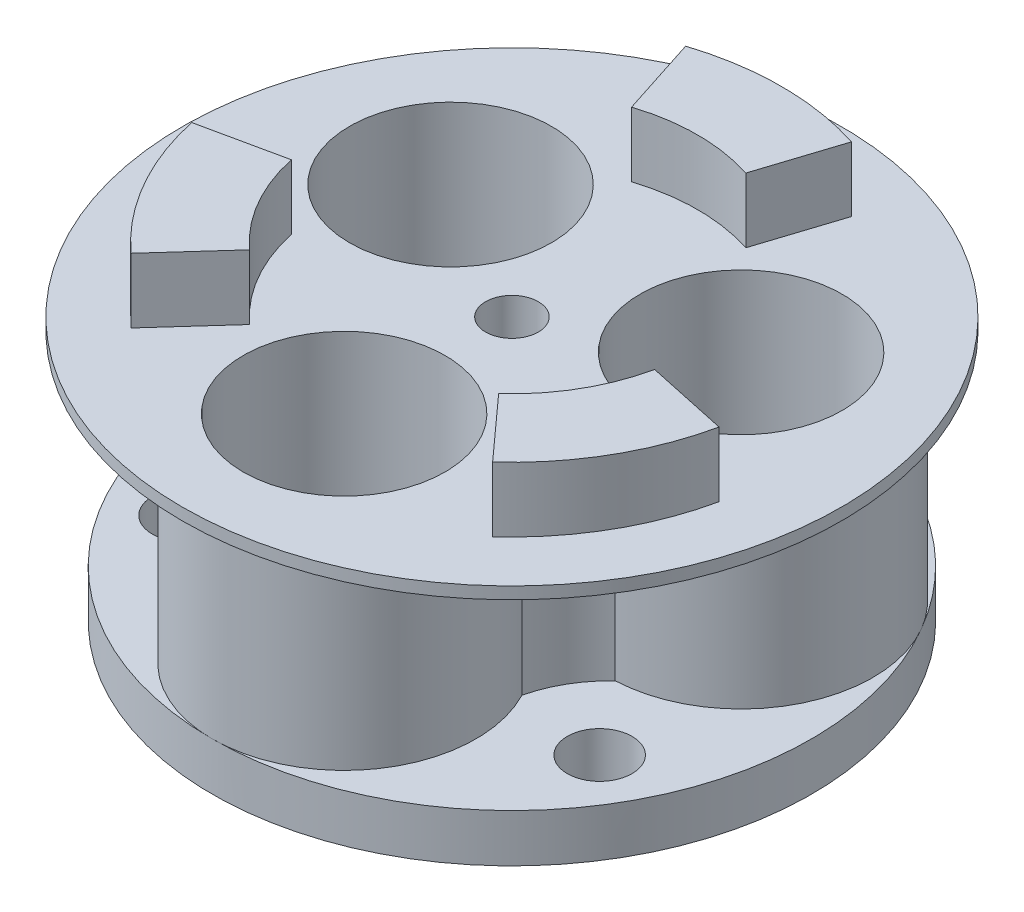
ISO-10303-21;
HEADER;
FILE_DESCRIPTION(('STEP AP214'),'2;1');
FILE_NAME('part.step','',(''),(''),'','','');
FILE_SCHEMA(('AUTOMOTIVE_DESIGN { 1 0 10303 214 1 1 1 1 }'));
ENDSEC;
DATA;
#1=APPLICATION_CONTEXT('core data for automotive mechanical design processes');
#2=APPLICATION_PROTOCOL_DEFINITION('international standard','automotive_design',2000,#1);
#3=PRODUCT_CONTEXT('',#1,'mechanical');
#4=PRODUCT('Part','Part','',(#3));
#5=PRODUCT_RELATED_PRODUCT_CATEGORY('part','',(#4));
#6=PRODUCT_DEFINITION_FORMATION('','',#4);
#7=PRODUCT_DEFINITION_CONTEXT('part definition',#1,'design');
#8=PRODUCT_DEFINITION('design','',#6,#7);
#9=PRODUCT_DEFINITION_SHAPE('','',#8);
#10=(LENGTH_UNIT() NAMED_UNIT(*) SI_UNIT(.MILLI.,.METRE.));
#11=(NAMED_UNIT(*) PLANE_ANGLE_UNIT() SI_UNIT($,.RADIAN.));
#12=(NAMED_UNIT(*) SI_UNIT($,.STERADIAN.) SOLID_ANGLE_UNIT());
#13=UNCERTAINTY_MEASURE_WITH_UNIT(LENGTH_MEASURE(1.E-05),#10,'distance_accuracy_value','');
#14=(GEOMETRIC_REPRESENTATION_CONTEXT(3) GLOBAL_UNCERTAINTY_ASSIGNED_CONTEXT((#13)) GLOBAL_UNIT_ASSIGNED_CONTEXT((#10,
#11,#12)) REPRESENTATION_CONTEXT('',''));
#15=CARTESIAN_POINT('',(0.,0.,0.));
#16=DIRECTION('',(0.,0.,1.));
#17=DIRECTION('',(1.,0.,0.));
#18=AXIS2_PLACEMENT_3D('',#15,#16,#17);
#19=CARTESIAN_POINT('',(0.,0.,0.));
#20=DIRECTION('',(0.,1.,0.));
#21=DIRECTION('',(0.,0.,1.));
#22=AXIS2_PLACEMENT_3D('',#19,#20,#21);
#23=PLANE('',#22);
#24=CARTESIAN_POINT('',(12.1243556529822,0.,-6.99999999999989));
#25=DIRECTION('',(0.,1.,0.));
#26=DIRECTION('',(0.,0.,1.));
#27=AXIS2_PLACEMENT_3D('',#24,#25,#26);
#28=CIRCLE('',#27,8.425);
#29=CARTESIAN_POINT('',(12.1243556529822,0.,1.42500000000011));
#30=VERTEX_POINT('',#29);
#31=EDGE_CURVE('E367',#30,#30,#28,.T.);
#32=ORIENTED_EDGE('',*,*,#31,.T.);
#33=EDGE_LOOP('',(#32));
#34=FACE_BOUND('',#33,.T.);
#35=CARTESIAN_POINT('',(-12.1243556529821,0.,-7.00000000000006));
#36=DIRECTION('',(0.,1.,0.));
#37=DIRECTION('',(0.,0.,1.));
#38=AXIS2_PLACEMENT_3D('',#35,#36,#37);
#39=CIRCLE('',#38,8.425);
#40=CARTESIAN_POINT('',(-12.1243556529821,0.,1.42499999999994));
#41=VERTEX_POINT('',#40);
#42=EDGE_CURVE('E372',#41,#41,#39,.T.);
#43=ORIENTED_EDGE('',*,*,#42,.T.);
#44=EDGE_LOOP('',(#43));
#45=FACE_BOUND('',#44,.T.);
#46=CARTESIAN_POINT('',(0.,0.,14.));
#47=DIRECTION('',(0.,1.,0.));
#48=DIRECTION('',(0.,0.,1.));
#49=AXIS2_PLACEMENT_3D('',#46,#47,#48);
#50=CIRCLE('',#49,8.425);
#51=CARTESIAN_POINT('',(0.,0.,22.425));
#52=VERTEX_POINT('',#51);
#53=EDGE_CURVE('E380',#52,#52,#50,.T.);
#54=ORIENTED_EDGE('',*,*,#53,.T.);
#55=EDGE_LOOP('',(#54));
#56=FACE_BOUND('',#55,.T.);
#57=CARTESIAN_POINT('',(0.,0.,0.));
#58=DIRECTION('',(0.,1.,0.));
#59=DIRECTION('',(0.,0.,1.));
#60=AXIS2_PLACEMENT_3D('',#57,#58,#59);
#61=CIRCLE('',#60,2.2);
#62=CARTESIAN_POINT('',(0.,0.,2.2));
#63=VERTEX_POINT('',#62);
#64=EDGE_CURVE('E388',#63,#63,#61,.T.);
#65=ORIENTED_EDGE('',*,*,#64,.T.);
#66=EDGE_LOOP('',(#65));
#67=FACE_BOUND('',#66,.T.);
#68=CARTESIAN_POINT('',(17.3205080756888,0.,10.));
#69=DIRECTION('',(0.,-1.,0.));
#70=DIRECTION('',(0.,0.,-1.));
#71=AXIS2_PLACEMENT_3D('',#68,#69,#70);
#72=CIRCLE('',#71,2.7);
#73=CARTESIAN_POINT('',(17.3205080756888,0.,7.30000000000001));
#74=VERTEX_POINT('',#73);
#75=EDGE_CURVE('E197',#74,#74,#72,.T.);
#76=ORIENTED_EDGE('',*,*,#75,.F.);
#77=EDGE_LOOP('',(#76));
#78=FACE_BOUND('',#77,.T.);
#79=CARTESIAN_POINT('',(-17.3205080756888,0.,10.));
#80=DIRECTION('',(0.,-1.,0.));
#81=DIRECTION('',(0.,0.,-1.));
#82=AXIS2_PLACEMENT_3D('',#79,#80,#81);
#83=CIRCLE('',#82,2.7);
#84=CARTESIAN_POINT('',(-17.3205080756888,0.,7.3));
#85=VERTEX_POINT('',#84);
#86=EDGE_CURVE('E867',#85,#85,#83,.T.);
#87=ORIENTED_EDGE('',*,*,#86,.F.);
#88=EDGE_LOOP('',(#87));
#89=FACE_BOUND('',#88,.T.);
#90=CARTESIAN_POINT('',(0.,0.,-20.));
#91=DIRECTION('',(0.,-1.,0.));
#92=DIRECTION('',(0.,0.,-1.));
#93=AXIS2_PLACEMENT_3D('',#90,#91,#92);
#94=CIRCLE('',#93,2.7);
#95=CARTESIAN_POINT('',(0.,0.,-22.7));
#96=VERTEX_POINT('',#95);
#97=EDGE_CURVE('E405',#96,#96,#94,.T.);
#98=ORIENTED_EDGE('',*,*,#97,.F.);
#99=EDGE_LOOP('',(#98));
#100=FACE_BOUND('',#99,.T.);
#101=CARTESIAN_POINT('',(0.,0.,0.));
#102=DIRECTION('',(0.,-1.,0.));
#103=DIRECTION('',(0.,0.,-1.));
#104=AXIS2_PLACEMENT_3D('',#101,#102,#103);
#105=CIRCLE('',#104,25.);
#106=CARTESIAN_POINT('',(0.,0.,-25.));
#107=VERTEX_POINT('',#106);
#108=EDGE_CURVE('E185',#107,#107,#105,.T.);
#109=ORIENTED_EDGE('',*,*,#108,.T.);
#110=EDGE_LOOP('',(#109));
#111=FACE_BOUND('',#110,.T.);
#112=ADVANCED_FACE('F41',(#34,#45,#56,#67,#78,#89,#100,#111),#23,.F.);
#113=CARTESIAN_POINT('',(0.,4.,0.));
#114=DIRECTION('',(0.,1.,0.));
#115=DIRECTION('',(0.,0.,1.));
#116=AXIS2_PLACEMENT_3D('',#113,#114,#115);
#117=PLANE('',#116);
#118=CARTESIAN_POINT('',(17.3205080756888,4.,10.));
#119=DIRECTION('',(0.,1.,0.));
#120=DIRECTION('',(0.,0.,1.));
#121=AXIS2_PLACEMENT_3D('',#118,#119,#120);
#122=CIRCLE('',#121,2.7);
#123=CARTESIAN_POINT('',(17.3205080756888,4.,12.7));
#124=VERTEX_POINT('',#123);
#125=EDGE_CURVE('E401',#124,#124,#122,.T.);
#126=ORIENTED_EDGE('',*,*,#125,.F.);
#127=EDGE_LOOP('',(#126));
#128=FACE_BOUND('',#127,.T.);
#129=CARTESIAN_POINT('',(1.42649182304901E-12,4.,13.9999999999991));
#130=DIRECTION('',(0.,1.,0.));
#131=DIRECTION('',(0.,0.,1.));
#132=AXIS2_PLACEMENT_3D('',#129,#130,#131);
#133=CIRCLE('',#132,11.);
#134=CARTESIAN_POINT('',(2.5473068268733E-12,4.,24.9999999999991));
#135=VERTEX_POINT('',#134);
#136=CARTESIAN_POINT('',(9.75951782142741,4.,8.92537568944486));
#137=VERTEX_POINT('',#136);
#138=EDGE_CURVE('E194',#135,#137,#133,.T.);
#139=ORIENTED_EDGE('',*,*,#138,.F.);
#140=CARTESIAN_POINT('',(0.,4.,0.));
#141=DIRECTION('',(0.,-1.,0.));
#142=DIRECTION('',(0.,0.,-1.));
#143=AXIS2_PLACEMENT_3D('',#140,#141,#142);
#144=CIRCLE('',#143,25.);
#145=CARTESIAN_POINT('',(21.6506350946097,4.,-12.5000000000022));
#146=VERTEX_POINT('',#145);
#147=EDGE_CURVE('E59',#146,#135,#144,.T.);
#148=ORIENTED_EDGE('',*,*,#147,.F.);
#149=CARTESIAN_POINT('',(12.1243556529822,4.,-7.00000000000166));
#150=DIRECTION('',(0.,1.,0.));
#151=DIRECTION('',(0.,0.,1.));
#152=AXIS2_PLACEMENT_3D('',#149,#150,#151);
#153=CIRCLE('',#152,11.);
#154=CARTESIAN_POINT('',(12.6093609960954,4.,3.98930251731724));
#155=VERTEX_POINT('',#154);
#156=EDGE_CURVE('E193',#155,#146,#153,.T.);
#157=ORIENTED_EDGE('',*,*,#156,.F.);
#158=CARTESIAN_POINT('',(19.4855715851499,4.,11.2499999999983));
#159=DIRECTION('',(0.,1.,0.));
#160=DIRECTION('',(0.,0.,1.));
#161=AXIS2_PLACEMENT_3D('',#158,#159,#160);
#162=CIRCLE('',#161,10.0000000000018);
#163=EDGE_CURVE('E213',#155,#137,#162,.T.);
#164=ORIENTED_EDGE('',*,*,#163,.T.);
#165=EDGE_LOOP('',(#139,#148,#157,#164));
#166=FACE_BOUND('',#165,.T.);
#167=ADVANCED_FACE('F190',(#128,#166),#117,.T.);
#168=CARTESIAN_POINT('',(0.,4.,-20.));
#169=DIRECTION('',(0.,1.,0.));
#170=DIRECTION('',(0.,0.,1.));
#171=AXIS2_PLACEMENT_3D('',#168,#169,#170);
#172=CIRCLE('',#171,2.7);
#173=CARTESIAN_POINT('',(0.,4.,-17.3));
#174=VERTEX_POINT('',#173);
#175=EDGE_CURVE('E45',#174,#174,#172,.T.);
#176=ORIENTED_EDGE('',*,*,#175,.F.);
#177=EDGE_LOOP('',(#176));
#178=FACE_BOUND('',#177,.T.);
#179=CARTESIAN_POINT('',(2.84984317466854,4.,-12.9146782067687));
#180=VERTEX_POINT('',#179);
#181=EDGE_CURVE('E199',#146,#180,#153,.T.);
#182=ORIENTED_EDGE('',*,*,#181,.F.);
#183=CARTESIAN_POINT('',(-21.6506350946109,4.,-12.5000000000001));
#184=VERTEX_POINT('',#183);
#185=EDGE_CURVE('E176',#184,#146,#144,.T.);
#186=ORIENTED_EDGE('',*,*,#185,.F.);
#187=CARTESIAN_POINT('',(-12.1243556529821,4.,-7.00000000000006));
#188=DIRECTION('',(0.,1.,0.));
#189=DIRECTION('',(0.,0.,1.));
#190=AXIS2_PLACEMENT_3D('',#187,#188,#189);
#191=CIRCLE('',#190,11.);
#192=CARTESIAN_POINT('',(-2.84984317466973,4.,-12.914678206769));
#193=VERTEX_POINT('',#192);
#194=EDGE_CURVE('E427',#193,#184,#191,.T.);
#195=ORIENTED_EDGE('',*,*,#194,.F.);
#196=CARTESIAN_POINT('',(0.,4.,-22.5));
#197=DIRECTION('',(0.,1.,0.));
#198=DIRECTION('',(0.,0.,1.));
#199=AXIS2_PLACEMENT_3D('',#196,#197,#198);
#200=CIRCLE('',#199,10.);
#201=EDGE_CURVE('E202',#193,#180,#200,.T.);
#202=ORIENTED_EDGE('',*,*,#201,.T.);
#203=EDGE_LOOP('',(#182,#186,#195,#202));
#204=FACE_BOUND('',#203,.T.);
#205=ADVANCED_FACE('F200',(#178,#204),#117,.T.);
#206=CARTESIAN_POINT('',(-17.3205080756888,4.,10.));
#207=DIRECTION('',(0.,1.,0.));
#208=DIRECTION('',(0.,0.,1.));
#209=AXIS2_PLACEMENT_3D('',#206,#207,#208);
#210=CIRCLE('',#209,2.7);
#211=CARTESIAN_POINT('',(-17.3205080756888,4.,12.7));
#212=VERTEX_POINT('',#211);
#213=EDGE_CURVE('E404',#212,#212,#210,.T.);
#214=ORIENTED_EDGE('',*,*,#213,.F.);
#215=EDGE_LOOP('',(#214));
#216=FACE_BOUND('',#215,.T.);
#217=CARTESIAN_POINT('',(-12.6093609960946,4.,3.98930251731888));
#218=VERTEX_POINT('',#217);
#219=EDGE_CURVE('E426',#184,#218,#191,.T.);
#220=ORIENTED_EDGE('',*,*,#219,.F.);
#221=EDGE_CURVE('E179',#135,#184,#144,.T.);
#222=ORIENTED_EDGE('',*,*,#221,.F.);
#223=CARTESIAN_POINT('',(-9.75951782142639,4.,8.92537568944838));
#224=VERTEX_POINT('',#223);
#225=EDGE_CURVE('E415',#224,#135,#133,.T.);
#226=ORIENTED_EDGE('',*,*,#225,.F.);
#227=CARTESIAN_POINT('',(-19.4855715851484,4.,11.2499999999992));
#228=DIRECTION('',(0.,1.,0.));
#229=DIRECTION('',(0.,0.,1.));
#230=AXIS2_PLACEMENT_3D('',#227,#228,#229);
#231=CIRCLE('',#230,10.0000000000007);
#232=EDGE_CURVE('E420',#224,#218,#231,.T.);
#233=ORIENTED_EDGE('',*,*,#232,.T.);
#234=EDGE_LOOP('',(#220,#222,#226,#233));
#235=FACE_BOUND('',#234,.T.);
#236=ADVANCED_FACE('F444',(#216,#235),#117,.T.);
#237=CARTESIAN_POINT('',(0.,22.,0.));
#238=DIRECTION('',(0.,1.,0.));
#239=DIRECTION('',(0.,0.,1.));
#240=AXIS2_PLACEMENT_3D('',#237,#238,#239);
#241=PLANE('',#240);
#242=CARTESIAN_POINT('',(0.,22.,0.));
#243=DIRECTION('',(0.,1.,0.));
#244=DIRECTION('',(0.,0.,1.));
#245=AXIS2_PLACEMENT_3D('',#242,#243,#244);
#246=CIRCLE('',#245,15.5);
#247=CARTESIAN_POINT('',(4.76402757589708,22.,-14.7497132601313));
#248=VERTEX_POINT('',#247);
#249=CARTESIAN_POINT('',(-4.76402757589696,22.,-14.7497132601313));
#250=VERTEX_POINT('',#249);
#251=EDGE_CURVE('E283',#248,#250,#246,.T.);
#252=ORIENTED_EDGE('',*,*,#251,.T.);
#253=DIRECTION('',(0.307356617799804,0.,0.951594403879439));
#254=VECTOR('',#253,1.);
#255=CARTESIAN_POINT('',(0.,22.,0.));
#256=LINE('',#255,#254);
#257=CARTESIAN_POINT('',(-6.91552390049559,22.,-21.4108740872874));
#258=VERTEX_POINT('',#257);
#259=EDGE_CURVE('E289',#258,#250,#256,.T.);
#260=ORIENTED_EDGE('',*,*,#259,.F.);
#261=CARTESIAN_POINT('',(0.,22.,0.));
#262=DIRECTION('',(0.,1.,0.));
#263=DIRECTION('',(0.,0.,1.));
#264=AXIS2_PLACEMENT_3D('',#261,#262,#263);
#265=CIRCLE('',#264,22.5);
#266=CARTESIAN_POINT('',(6.91552390049576,22.,-21.4108740872873));
#267=VERTEX_POINT('',#266);
#268=EDGE_CURVE('E307',#267,#258,#265,.T.);
#269=ORIENTED_EDGE('',*,*,#268,.F.);
#270=DIRECTION('',(-0.307356617799811,0.,0.951594403879437));
#271=VECTOR('',#270,1.);
#272=CARTESIAN_POINT('',(0.,22.,0.));
#273=LINE('',#272,#271);
#274=EDGE_CURVE('E303',#267,#248,#273,.T.);
#275=ORIENTED_EDGE('',*,*,#274,.T.);
#276=EDGE_LOOP('',(#252,#260,#269,#275));
#277=FACE_BOUND('',#276,.T.);
#278=CARTESIAN_POINT('',(0.,22.,0.));
#279=DIRECTION('',(0.,1.,0.));
#280=DIRECTION('',(0.,0.,1.));
#281=AXIS2_PLACEMENT_3D('',#278,#279,#280);
#282=CIRCLE('',#281,15.5);
#283=CARTESIAN_POINT('',(-15.1556401697584,22.,3.24908772500916));
#284=VERTEX_POINT('',#283);
#285=CARTESIAN_POINT('',(-10.3916125938614,22.,11.500625535122));
#286=VERTEX_POINT('',#285);
#287=EDGE_CURVE('E325',#284,#286,#282,.T.);
#288=ORIENTED_EDGE('',*,*,#287,.T.);
#289=DIRECTION('',(0.670426618958802,0.,-0.741975840975614));
#290=VECTOR('',#289,1.);
#291=CARTESIAN_POINT('',(0.,22.,0.));
#292=LINE('',#291,#290);
#293=CARTESIAN_POINT('',(-15.0845989265731,22.,16.6944564219513));
#294=VERTEX_POINT('',#293);
#295=EDGE_CURVE('E331',#294,#286,#292,.T.);
#296=ORIENTED_EDGE('',*,*,#295,.F.);
#297=CARTESIAN_POINT('',(0.,22.,0.));
#298=DIRECTION('',(0.,1.,0.));
#299=DIRECTION('',(0.,0.,1.));
#300=AXIS2_PLACEMENT_3D('',#297,#298,#299);
#301=CIRCLE('',#300,22.5);
#302=CARTESIAN_POINT('',(-22.0001228270687,22.,4.71641766533588));
#303=VERTEX_POINT('',#302);
#304=EDGE_CURVE('E349',#303,#294,#301,.T.);
#305=ORIENTED_EDGE('',*,*,#304,.F.);
#306=DIRECTION('',(0.977783236758607,0.,-0.209618562903818));
#307=VECTOR('',#306,1.);
#308=CARTESIAN_POINT('',(0.,22.,0.));
#309=LINE('',#308,#307);
#310=EDGE_CURVE('E345',#303,#284,#309,.T.);
#311=ORIENTED_EDGE('',*,*,#310,.T.);
#312=EDGE_LOOP('',(#288,#296,#305,#311));
#313=FACE_BOUND('',#312,.T.);
#314=CARTESIAN_POINT('',(-12.1243556529821,22.,-7.00000000000006));
#315=DIRECTION('',(0.,1.,0.));
#316=DIRECTION('',(0.,0.,1.));
#317=AXIS2_PLACEMENT_3D('',#314,#315,#316);
#318=CIRCLE('',#317,8.425);
#319=CARTESIAN_POINT('',(-12.1243556529821,22.,1.42499999999994));
#320=VERTEX_POINT('',#319);
#321=EDGE_CURVE('E376',#320,#320,#318,.T.);
#322=ORIENTED_EDGE('',*,*,#321,.F.);
#323=EDGE_LOOP('',(#322));
#324=FACE_BOUND('',#323,.T.);
#325=CARTESIAN_POINT('',(0.,22.,0.));
#326=DIRECTION('',(0.,1.,0.));
#327=DIRECTION('',(0.,0.,1.));
#328=AXIS2_PLACEMENT_3D('',#325,#326,#327);
#329=CIRCLE('',#328,2.2);
#330=CARTESIAN_POINT('',(0.,22.,2.2));
#331=VERTEX_POINT('',#330);
#332=EDGE_CURVE('E51',#331,#331,#329,.T.);
#333=ORIENTED_EDGE('',*,*,#332,.F.);
#334=EDGE_LOOP('',(#333));
#335=FACE_BOUND('',#334,.T.);
#336=CARTESIAN_POINT('',(0.,22.,0.));
#337=DIRECTION('',(0.,1.,0.));
#338=DIRECTION('',(0.,0.,1.));
#339=AXIS2_PLACEMENT_3D('',#336,#337,#338);
#340=CIRCLE('',#339,27.5);
#341=CARTESIAN_POINT('',(0.,22.,27.5));
#342=VERTEX_POINT('',#341);
#343=EDGE_CURVE('E11',#342,#342,#340,.T.);
#344=ORIENTED_EDGE('',*,*,#343,.T.);
#345=EDGE_LOOP('',(#344));
#346=FACE_BOUND('',#345,.T.);
#347=CARTESIAN_POINT('',(0.,22.,14.));
#348=DIRECTION('',(0.,1.,0.));
#349=DIRECTION('',(0.,0.,1.));
#350=AXIS2_PLACEMENT_3D('',#347,#348,#349);
#351=CIRCLE('',#350,8.425);
#352=CARTESIAN_POINT('',(0.,22.,22.425));
#353=VERTEX_POINT('',#352);
#354=EDGE_CURVE('E384',#353,#353,#351,.T.);
#355=ORIENTED_EDGE('',*,*,#354,.F.);
#356=EDGE_LOOP('',(#355));
#357=FACE_BOUND('',#356,.T.);
#358=CARTESIAN_POINT('',(12.1243556529822,22.,-6.99999999999989));
#359=DIRECTION('',(0.,1.,0.));
#360=DIRECTION('',(0.,0.,1.));
#361=AXIS2_PLACEMENT_3D('',#358,#359,#360);
#362=CIRCLE('',#361,8.425);
#363=CARTESIAN_POINT('',(12.1243556529822,22.,1.42500000000011));
#364=VERTEX_POINT('',#363);
#365=EDGE_CURVE('E368',#364,#364,#362,.T.);
#366=ORIENTED_EDGE('',*,*,#365,.F.);
#367=EDGE_LOOP('',(#366));
#368=FACE_BOUND('',#367,.T.);
#369=DIRECTION('',(-0.977783236758605,0.,-0.209618562903826));
#370=VECTOR('',#369,1.);
#371=CARTESIAN_POINT('',(0.,22.,0.));
#372=LINE('',#371,#370);
#373=CARTESIAN_POINT('',(22.0001228270686,22.,4.71641766533608));
#374=VERTEX_POINT('',#373);
#375=CARTESIAN_POINT('',(15.1556401697584,22.,3.2490877250093));
#376=VERTEX_POINT('',#375);
#377=EDGE_CURVE('E67',#374,#376,#372,.T.);
#378=ORIENTED_EDGE('',*,*,#377,.F.);
#379=CARTESIAN_POINT('',(0.,22.,0.));
#380=DIRECTION('',(0.,1.,0.));
#381=DIRECTION('',(0.,0.,1.));
#382=AXIS2_PLACEMENT_3D('',#379,#380,#381);
#383=CIRCLE('',#382,22.5);
#384=CARTESIAN_POINT('',(15.0845989265729,22.,16.6944564219515));
#385=VERTEX_POINT('',#384);
#386=EDGE_CURVE('E258',#385,#374,#383,.T.);
#387=ORIENTED_EDGE('',*,*,#386,.F.);
#388=DIRECTION('',(-0.670426618958796,0.,-0.74197584097562));
#389=VECTOR('',#388,1.);
#390=CARTESIAN_POINT('',(0.,22.,0.));
#391=LINE('',#390,#389);
#392=CARTESIAN_POINT('',(10.3916125938613,22.,11.5006255351221));
#393=VERTEX_POINT('',#392);
#394=EDGE_CURVE('E246',#385,#393,#391,.T.);
#395=ORIENTED_EDGE('',*,*,#394,.T.);
#396=CARTESIAN_POINT('',(0.,22.,0.));
#397=DIRECTION('',(0.,1.,0.));
#398=DIRECTION('',(0.,0.,1.));
#399=AXIS2_PLACEMENT_3D('',#396,#397,#398);
#400=CIRCLE('',#399,15.5);
#401=EDGE_CURVE('E264',#393,#376,#400,.T.);
#402=ORIENTED_EDGE('',*,*,#401,.T.);
#403=EDGE_LOOP('',(#378,#387,#395,#402));
#404=FACE_BOUND('',#403,.T.);
#405=ADVANCED_FACE('F489',(#277,#313,#324,#335,#346,#357,#368,#404),#241,.T.);
#406=CARTESIAN_POINT('',(0.,22.,0.));
#407=DIRECTION('',(0.,-1.,0.));
#408=DIRECTION('',(0.,0.,-1.));
#409=AXIS2_PLACEMENT_3D('',#406,#407,#408);
#410=CYLINDRICAL_SURFACE('',#409,27.5);
#411=CARTESIAN_POINT('',(0.,21.,0.));
#412=DIRECTION('',(0.,1.,0.));
#413=DIRECTION('',(0.,0.,1.));
#414=AXIS2_PLACEMENT_3D('',#411,#412,#413);
#415=CIRCLE('',#414,27.5);
#416=CARTESIAN_POINT('',(0.,21.,27.5));
#417=VERTEX_POINT('',#416);
#418=EDGE_CURVE('E240',#417,#417,#415,.T.);
#419=ORIENTED_EDGE('',*,*,#418,.T.);
#420=EDGE_LOOP('',(#419));
#421=FACE_BOUND('',#420,.T.);
#422=ORIENTED_EDGE('',*,*,#343,.F.);
#423=EDGE_LOOP('',(#422));
#424=FACE_BOUND('',#423,.T.);
#425=ADVANCED_FACE('F43',(#421,#424),#410,.T.);
#426=CARTESIAN_POINT('',(0.,22.,0.));
#427=DIRECTION('',(0.,-1.,0.));
#428=DIRECTION('',(0.,0.,-1.));
#429=AXIS2_PLACEMENT_3D('',#426,#427,#428);
#430=CYLINDRICAL_SURFACE('',#429,2.2);
#431=ORIENTED_EDGE('',*,*,#332,.T.);
#432=EDGE_LOOP('',(#431));
#433=FACE_BOUND('',#432,.T.);
#434=ORIENTED_EDGE('',*,*,#64,.F.);
#435=EDGE_LOOP('',(#434));
#436=FACE_BOUND('',#435,.T.);
#437=ADVANCED_FACE('F493',(#433,#436),#430,.F.);
#438=CARTESIAN_POINT('',(0.,22.,14.));
#439=DIRECTION('',(0.,-1.,0.));
#440=DIRECTION('',(0.,0.,-1.));
#441=AXIS2_PLACEMENT_3D('',#438,#439,#440);
#442=CYLINDRICAL_SURFACE('',#441,8.425);
#443=ORIENTED_EDGE('',*,*,#354,.T.);
#444=EDGE_LOOP('',(#443));
#445=FACE_BOUND('',#444,.T.);
#446=ORIENTED_EDGE('',*,*,#53,.F.);
#447=EDGE_LOOP('',(#446));
#448=FACE_BOUND('',#447,.T.);
#449=ADVANCED_FACE('F496',(#445,#448),#442,.F.);
#450=CARTESIAN_POINT('',(-12.1243556529821,22.,-7.00000000000006));
#451=DIRECTION('',(0.,-1.,0.));
#452=DIRECTION('',(0.,0.,-1.));
#453=AXIS2_PLACEMENT_3D('',#450,#451,#452);
#454=CYLINDRICAL_SURFACE('',#453,8.425);
#455=ORIENTED_EDGE('',*,*,#321,.T.);
#456=EDGE_LOOP('',(#455));
#457=FACE_BOUND('',#456,.T.);
#458=ORIENTED_EDGE('',*,*,#42,.F.);
#459=EDGE_LOOP('',(#458));
#460=FACE_BOUND('',#459,.T.);
#461=ADVANCED_FACE('F500',(#457,#460),#454,.F.);
#462=CARTESIAN_POINT('',(12.1243556529822,22.,-6.99999999999989));
#463=DIRECTION('',(0.,-1.,0.));
#464=DIRECTION('',(0.,0.,-1.));
#465=AXIS2_PLACEMENT_3D('',#462,#463,#464);
#466=CYLINDRICAL_SURFACE('',#465,8.425);
#467=ORIENTED_EDGE('',*,*,#365,.T.);
#468=EDGE_LOOP('',(#467));
#469=FACE_BOUND('',#468,.T.);
#470=ORIENTED_EDGE('',*,*,#31,.F.);
#471=EDGE_LOOP('',(#470));
#472=FACE_BOUND('',#471,.T.);
#473=ADVANCED_FACE('F504',(#469,#472),#466,.F.);
#474=CARTESIAN_POINT('',(0.,27.4,0.));
#475=DIRECTION('',(0.,-1.,0.));
#476=DIRECTION('',(0.,0.,-1.));
#477=AXIS2_PLACEMENT_3D('',#474,#475,#476);
#478=CYLINDRICAL_SURFACE('',#477,15.5);
#479=ORIENTED_EDGE('',*,*,#287,.F.);
#480=DIRECTION('',(0.,-1.,0.));
#481=VECTOR('',#480,1.);
#482=CARTESIAN_POINT('',(-15.1556401697584,27.4,3.24908772500916));
#483=LINE('',#482,#481);
#484=CARTESIAN_POINT('',(-15.1556401697584,27.4,3.24908772500916));
#485=VERTEX_POINT('',#484);
#486=EDGE_CURVE('E364',#485,#284,#483,.T.);
#487=ORIENTED_EDGE('',*,*,#486,.F.);
#488=CARTESIAN_POINT('',(0.,27.4,0.));
#489=DIRECTION('',(0.,1.,0.));
#490=DIRECTION('',(0.,0.,1.));
#491=AXIS2_PLACEMENT_3D('',#488,#489,#490);
#492=CIRCLE('',#491,15.5);
#493=CARTESIAN_POINT('',(-10.3916125938614,27.4,11.500625535122));
#494=VERTEX_POINT('',#493);
#495=EDGE_CURVE('E326',#485,#494,#492,.T.);
#496=ORIENTED_EDGE('',*,*,#495,.T.);
#497=DIRECTION('',(0.,-1.,0.));
#498=VECTOR('',#497,1.);
#499=CARTESIAN_POINT('',(-10.3916125938614,27.4,11.500625535122));
#500=LINE('',#499,#498);
#501=EDGE_CURVE('E341',#494,#286,#500,.T.);
#502=ORIENTED_EDGE('',*,*,#501,.T.);
#503=EDGE_LOOP('',(#479,#487,#496,#502));
#504=FACE_BOUND('',#503,.T.);
#505=ADVANCED_FACE('F508',(#504),#478,.F.);
#506=CARTESIAN_POINT('',(0.,27.4,0.));
#507=DIRECTION('',(-0.209618562903818,0.,-0.977783236758607));
#508=DIRECTION('',(-0.977783236758607,0.,0.209618562903818));
#509=AXIS2_PLACEMENT_3D('',#506,#507,#508);
#510=PLANE('',#509);
#511=ORIENTED_EDGE('',*,*,#310,.F.);
#512=DIRECTION('',(0.,-1.,0.));
#513=VECTOR('',#512,1.);
#514=CARTESIAN_POINT('',(-22.0001228270687,27.4,4.71641766533588));
#515=LINE('',#514,#513);
#516=CARTESIAN_POINT('',(-22.0001228270687,27.4,4.71641766533588));
#517=VERTEX_POINT('',#516);
#518=EDGE_CURVE('E361',#517,#303,#515,.T.);
#519=ORIENTED_EDGE('',*,*,#518,.F.);
#520=DIRECTION('',(0.977783236758607,0.,-0.209618562903818));
#521=VECTOR('',#520,1.);
#522=CARTESIAN_POINT('',(0.,27.4,0.));
#523=LINE('',#522,#521);
#524=EDGE_CURVE('E330',#517,#485,#523,.T.);
#525=ORIENTED_EDGE('',*,*,#524,.T.);
#526=ORIENTED_EDGE('',*,*,#486,.T.);
#527=EDGE_LOOP('',(#511,#519,#525,#526));
#528=FACE_BOUND('',#527,.T.);
#529=ADVANCED_FACE('F512',(#528),#510,.T.);
#530=CARTESIAN_POINT('',(0.,27.4,0.));
#531=DIRECTION('',(0.,-1.,0.));
#532=DIRECTION('',(0.,0.,-1.));
#533=AXIS2_PLACEMENT_3D('',#530,#531,#532);
#534=CYLINDRICAL_SURFACE('',#533,22.5);
#535=ORIENTED_EDGE('',*,*,#304,.T.);
#536=DIRECTION('',(0.,-1.,0.));
#537=VECTOR('',#536,1.);
#538=CARTESIAN_POINT('',(-15.084598926573,27.4,16.6944564219513));
#539=LINE('',#538,#537);
#540=CARTESIAN_POINT('',(-15.084598926573,27.4,16.6944564219513));
#541=VERTEX_POINT('',#540);
#542=EDGE_CURVE('E358',#541,#294,#539,.T.);
#543=ORIENTED_EDGE('',*,*,#542,.F.);
#544=CARTESIAN_POINT('',(0.,27.4,0.));
#545=DIRECTION('',(0.,1.,0.));
#546=DIRECTION('',(0.,0.,1.));
#547=AXIS2_PLACEMENT_3D('',#544,#545,#546);
#548=CIRCLE('',#547,22.5);
#549=EDGE_CURVE('E335',#517,#541,#548,.T.);
#550=ORIENTED_EDGE('',*,*,#549,.F.);
#551=ORIENTED_EDGE('',*,*,#518,.T.);
#552=EDGE_LOOP('',(#535,#543,#550,#551));
#553=FACE_BOUND('',#552,.T.);
#554=ADVANCED_FACE('F516',(#553),#534,.T.);
#555=CARTESIAN_POINT('',(0.,27.4,0.));
#556=DIRECTION('',(-0.741975840975614,0.,-0.670426618958802));
#557=DIRECTION('',(-0.670426618958802,0.,0.741975840975614));
#558=AXIS2_PLACEMENT_3D('',#555,#556,#557);
#559=PLANE('',#558);
#560=ORIENTED_EDGE('',*,*,#295,.T.);
#561=ORIENTED_EDGE('',*,*,#501,.F.);
#562=DIRECTION('',(0.670426618958802,0.,-0.741975840975614));
#563=VECTOR('',#562,1.);
#564=CARTESIAN_POINT('',(0.,27.4,0.));
#565=LINE('',#564,#563);
#566=EDGE_CURVE('E338',#541,#494,#565,.T.);
#567=ORIENTED_EDGE('',*,*,#566,.F.);
#568=ORIENTED_EDGE('',*,*,#542,.T.);
#569=EDGE_LOOP('',(#560,#561,#567,#568));
#570=FACE_BOUND('',#569,.T.);
#571=ADVANCED_FACE('F520',(#570),#559,.F.);
#572=CARTESIAN_POINT('',(0.,27.4,0.));
#573=DIRECTION('',(0.,1.,0.));
#574=DIRECTION('',(0.,0.,1.));
#575=AXIS2_PLACEMENT_3D('',#572,#573,#574);
#576=PLANE('',#575);
#577=ORIENTED_EDGE('',*,*,#495,.F.);
#578=ORIENTED_EDGE('',*,*,#524,.F.);
#579=ORIENTED_EDGE('',*,*,#549,.T.);
#580=ORIENTED_EDGE('',*,*,#566,.T.);
#581=EDGE_LOOP('',(#577,#578,#579,#580));
#582=FACE_BOUND('',#581,.T.);
#583=ADVANCED_FACE('F524',(#582),#576,.T.);
#584=CARTESIAN_POINT('',(0.,27.4,0.));
#585=DIRECTION('',(0.,-1.,0.));
#586=DIRECTION('',(0.,0.,-1.));
#587=AXIS2_PLACEMENT_3D('',#584,#585,#586);
#588=CYLINDRICAL_SURFACE('',#587,15.5);
#589=ORIENTED_EDGE('',*,*,#251,.F.);
#590=DIRECTION('',(0.,-1.,0.));
#591=VECTOR('',#590,1.);
#592=CARTESIAN_POINT('',(4.76402757589708,27.4,-14.7497132601313));
#593=LINE('',#592,#591);
#594=CARTESIAN_POINT('',(4.76402757589708,27.4,-14.7497132601313));
#595=VERTEX_POINT('',#594);
#596=EDGE_CURVE('E322',#595,#248,#593,.T.);
#597=ORIENTED_EDGE('',*,*,#596,.F.);
#598=CARTESIAN_POINT('',(0.,27.4,0.));
#599=DIRECTION('',(0.,1.,0.));
#600=DIRECTION('',(0.,0.,1.));
#601=AXIS2_PLACEMENT_3D('',#598,#599,#600);
#602=CIRCLE('',#601,15.5);
#603=CARTESIAN_POINT('',(-4.76402757589696,27.4,-14.7497132601313));
#604=VERTEX_POINT('',#603);
#605=EDGE_CURVE('E284',#595,#604,#602,.T.);
#606=ORIENTED_EDGE('',*,*,#605,.T.);
#607=DIRECTION('',(0.,-1.,0.));
#608=VECTOR('',#607,1.);
#609=CARTESIAN_POINT('',(-4.76402757589696,27.4,-14.7497132601313));
#610=LINE('',#609,#608);
#611=EDGE_CURVE('E299',#604,#250,#610,.T.);
#612=ORIENTED_EDGE('',*,*,#611,.T.);
#613=EDGE_LOOP('',(#589,#597,#606,#612));
#614=FACE_BOUND('',#613,.T.);
#615=ADVANCED_FACE('F528',(#614),#588,.F.);
#616=CARTESIAN_POINT('',(0.,27.4,0.));
#617=DIRECTION('',(0.951594403879437,0.,0.307356617799811));
#618=DIRECTION('',(0.307356617799811,0.,-0.951594403879437));
#619=AXIS2_PLACEMENT_3D('',#616,#617,#618);
#620=PLANE('',#619);
#621=ORIENTED_EDGE('',*,*,#274,.F.);
#622=DIRECTION('',(0.,-1.,0.));
#623=VECTOR('',#622,1.);
#624=CARTESIAN_POINT('',(6.91552390049576,27.4,-21.4108740872873));
#625=LINE('',#624,#623);
#626=CARTESIAN_POINT('',(6.91552390049576,27.4,-21.4108740872873));
#627=VERTEX_POINT('',#626);
#628=EDGE_CURVE('E319',#627,#267,#625,.T.);
#629=ORIENTED_EDGE('',*,*,#628,.F.);
#630=DIRECTION('',(-0.307356617799811,0.,0.951594403879437));
#631=VECTOR('',#630,1.);
#632=CARTESIAN_POINT('',(0.,27.4,0.));
#633=LINE('',#632,#631);
#634=EDGE_CURVE('E288',#627,#595,#633,.T.);
#635=ORIENTED_EDGE('',*,*,#634,.T.);
#636=ORIENTED_EDGE('',*,*,#596,.T.);
#637=EDGE_LOOP('',(#621,#629,#635,#636));
#638=FACE_BOUND('',#637,.T.);
#639=ADVANCED_FACE('F532',(#638),#620,.T.);
#640=CARTESIAN_POINT('',(0.,27.4,0.));
#641=DIRECTION('',(0.,-1.,0.));
#642=DIRECTION('',(0.,0.,-1.));
#643=AXIS2_PLACEMENT_3D('',#640,#641,#642);
#644=CYLINDRICAL_SURFACE('',#643,22.5);
#645=ORIENTED_EDGE('',*,*,#268,.T.);
#646=DIRECTION('',(0.,-1.,0.));
#647=VECTOR('',#646,1.);
#648=CARTESIAN_POINT('',(-6.91552390049559,27.4,-21.4108740872874));
#649=LINE('',#648,#647);
#650=CARTESIAN_POINT('',(-6.91552390049559,27.4,-21.4108740872874));
#651=VERTEX_POINT('',#650);
#652=EDGE_CURVE('E316',#651,#258,#649,.T.);
#653=ORIENTED_EDGE('',*,*,#652,.F.);
#654=CARTESIAN_POINT('',(0.,27.4,0.));
#655=DIRECTION('',(0.,1.,0.));
#656=DIRECTION('',(0.,0.,1.));
#657=AXIS2_PLACEMENT_3D('',#654,#655,#656);
#658=CIRCLE('',#657,22.5);
#659=EDGE_CURVE('E293',#627,#651,#658,.T.);
#660=ORIENTED_EDGE('',*,*,#659,.F.);
#661=ORIENTED_EDGE('',*,*,#628,.T.);
#662=EDGE_LOOP('',(#645,#653,#660,#661));
#663=FACE_BOUND('',#662,.T.);
#664=ADVANCED_FACE('F536',(#663),#644,.T.);
#665=CARTESIAN_POINT('',(0.,27.4,0.));
#666=DIRECTION('',(0.951594403879439,0.,-0.307356617799804));
#667=DIRECTION('',(-0.307356617799804,0.,-0.951594403879439));
#668=AXIS2_PLACEMENT_3D('',#665,#666,#667);
#669=PLANE('',#668);
#670=ORIENTED_EDGE('',*,*,#259,.T.);
#671=ORIENTED_EDGE('',*,*,#611,.F.);
#672=DIRECTION('',(0.307356617799804,0.,0.951594403879439));
#673=VECTOR('',#672,1.);
#674=CARTESIAN_POINT('',(0.,27.4,0.));
#675=LINE('',#674,#673);
#676=EDGE_CURVE('E296',#651,#604,#675,.T.);
#677=ORIENTED_EDGE('',*,*,#676,.F.);
#678=ORIENTED_EDGE('',*,*,#652,.T.);
#679=EDGE_LOOP('',(#670,#671,#677,#678));
#680=FACE_BOUND('',#679,.T.);
#681=ADVANCED_FACE('F540',(#680),#669,.F.);
#682=CARTESIAN_POINT('',(0.,27.4,0.));
#683=DIRECTION('',(0.,1.,0.));
#684=DIRECTION('',(0.,0.,1.));
#685=AXIS2_PLACEMENT_3D('',#682,#683,#684);
#686=PLANE('',#685);
#687=ORIENTED_EDGE('',*,*,#605,.F.);
#688=ORIENTED_EDGE('',*,*,#634,.F.);
#689=ORIENTED_EDGE('',*,*,#659,.T.);
#690=ORIENTED_EDGE('',*,*,#676,.T.);
#691=EDGE_LOOP('',(#687,#688,#689,#690));
#692=FACE_BOUND('',#691,.T.);
#693=ADVANCED_FACE('F544',(#692),#686,.T.);
#694=CARTESIAN_POINT('',(0.,27.4,0.));
#695=DIRECTION('',(0.,-1.,0.));
#696=DIRECTION('',(0.,0.,-1.));
#697=AXIS2_PLACEMENT_3D('',#694,#695,#696);
#698=CYLINDRICAL_SURFACE('',#697,22.5);
#699=ORIENTED_EDGE('',*,*,#386,.T.);
#700=DIRECTION('',(0.,-1.,0.));
#701=VECTOR('',#700,1.);
#702=CARTESIAN_POINT('',(22.0001228270686,27.4,4.71641766533608));
#703=LINE('',#702,#701);
#704=CARTESIAN_POINT('',(22.0001228270686,27.4,4.71641766533608));
#705=VERTEX_POINT('',#704);
#706=EDGE_CURVE('E280',#705,#374,#703,.T.);
#707=ORIENTED_EDGE('',*,*,#706,.F.);
#708=CARTESIAN_POINT('',(0.,27.4,0.));
#709=DIRECTION('',(0.,1.,0.));
#710=DIRECTION('',(0.,0.,1.));
#711=AXIS2_PLACEMENT_3D('',#708,#709,#710);
#712=CIRCLE('',#711,22.5);
#713=CARTESIAN_POINT('',(15.0845989265729,27.4,16.6944564219515));
#714=VERTEX_POINT('',#713);
#715=EDGE_CURVE('E241',#714,#705,#712,.T.);
#716=ORIENTED_EDGE('',*,*,#715,.F.);
#717=DIRECTION('',(0.,-1.,0.));
#718=VECTOR('',#717,1.);
#719=CARTESIAN_POINT('',(15.0845989265729,27.4,16.6944564219515));
#720=LINE('',#719,#718);
#721=EDGE_CURVE('E257',#714,#385,#720,.T.);
#722=ORIENTED_EDGE('',*,*,#721,.T.);
#723=EDGE_LOOP('',(#699,#707,#716,#722));
#724=FACE_BOUND('',#723,.T.);
#725=ADVANCED_FACE('F548',(#724),#698,.T.);
#726=CARTESIAN_POINT('',(0.,27.4,0.));
#727=DIRECTION('',(-0.209618562903826,0.,0.977783236758605));
#728=DIRECTION('',(0.977783236758605,0.,0.209618562903826));
#729=AXIS2_PLACEMENT_3D('',#726,#727,#728);
#730=PLANE('',#729);
#731=ORIENTED_EDGE('',*,*,#377,.T.);
#732=DIRECTION('',(0.,-1.,0.));
#733=VECTOR('',#732,1.);
#734=CARTESIAN_POINT('',(15.1556401697584,27.4,3.2490877250093));
#735=LINE('',#734,#733);
#736=CARTESIAN_POINT('',(15.1556401697584,27.4,3.2490877250093));
#737=VERTEX_POINT('',#736);
#738=EDGE_CURVE('E276',#737,#376,#735,.T.);
#739=ORIENTED_EDGE('',*,*,#738,.F.);
#740=DIRECTION('',(-0.977783236758605,0.,-0.209618562903826));
#741=VECTOR('',#740,1.);
#742=CARTESIAN_POINT('',(0.,27.4,0.));
#743=LINE('',#742,#741);
#744=EDGE_CURVE('E245',#705,#737,#743,.T.);
#745=ORIENTED_EDGE('',*,*,#744,.F.);
#746=ORIENTED_EDGE('',*,*,#706,.T.);
#747=EDGE_LOOP('',(#731,#739,#745,#746));
#748=FACE_BOUND('',#747,.T.);
#749=ADVANCED_FACE('F552',(#748),#730,.F.);
#750=CARTESIAN_POINT('',(0.,27.4,0.));
#751=DIRECTION('',(0.,-1.,0.));
#752=DIRECTION('',(0.,0.,-1.));
#753=AXIS2_PLACEMENT_3D('',#750,#751,#752);
#754=CYLINDRICAL_SURFACE('',#753,15.5);
#755=ORIENTED_EDGE('',*,*,#401,.F.);
#756=DIRECTION('',(0.,-1.,0.));
#757=VECTOR('',#756,1.);
#758=CARTESIAN_POINT('',(10.3916125938613,27.4,11.5006255351221));
#759=LINE('',#758,#757);
#760=CARTESIAN_POINT('',(10.3916125938613,27.4,11.5006255351221));
#761=VERTEX_POINT('',#760);
#762=EDGE_CURVE('E272',#761,#393,#759,.T.);
#763=ORIENTED_EDGE('',*,*,#762,.F.);
#764=CARTESIAN_POINT('',(0.,27.4,0.));
#765=DIRECTION('',(0.,1.,0.));
#766=DIRECTION('',(0.,0.,1.));
#767=AXIS2_PLACEMENT_3D('',#764,#765,#766);
#768=CIRCLE('',#767,15.5);
#769=EDGE_CURVE('E249',#761,#737,#768,.T.);
#770=ORIENTED_EDGE('',*,*,#769,.T.);
#771=ORIENTED_EDGE('',*,*,#738,.T.);
#772=EDGE_LOOP('',(#755,#763,#770,#771));
#773=FACE_BOUND('',#772,.T.);
#774=ADVANCED_FACE('F556',(#773),#754,.F.);
#775=CARTESIAN_POINT('',(0.,27.4,0.));
#776=DIRECTION('',(-0.741975840975619,0.,0.670426618958796));
#777=DIRECTION('',(0.670426618958796,0.,0.74197584097562));
#778=AXIS2_PLACEMENT_3D('',#775,#776,#777);
#779=PLANE('',#778);
#780=ORIENTED_EDGE('',*,*,#394,.F.);
#781=ORIENTED_EDGE('',*,*,#721,.F.);
#782=DIRECTION('',(-0.670426618958796,0.,-0.74197584097562));
#783=VECTOR('',#782,1.);
#784=CARTESIAN_POINT('',(0.,27.4,0.));
#785=LINE('',#784,#783);
#786=EDGE_CURVE('E253',#714,#761,#785,.T.);
#787=ORIENTED_EDGE('',*,*,#786,.T.);
#788=ORIENTED_EDGE('',*,*,#762,.T.);
#789=EDGE_LOOP('',(#780,#781,#787,#788));
#790=FACE_BOUND('',#789,.T.);
#791=ADVANCED_FACE('F560',(#790),#779,.T.);
#792=CARTESIAN_POINT('',(0.,27.4,0.));
#793=DIRECTION('',(0.,1.,0.));
#794=DIRECTION('',(0.,0.,1.));
#795=AXIS2_PLACEMENT_3D('',#792,#793,#794);
#796=PLANE('',#795);
#797=ORIENTED_EDGE('',*,*,#715,.T.);
#798=ORIENTED_EDGE('',*,*,#744,.T.);
#799=ORIENTED_EDGE('',*,*,#769,.F.);
#800=ORIENTED_EDGE('',*,*,#786,.F.);
#801=EDGE_LOOP('',(#797,#798,#799,#800));
#802=FACE_BOUND('',#801,.T.);
#803=ADVANCED_FACE('F564',(#802),#796,.T.);
#804=CARTESIAN_POINT('',(0.,21.,0.));
#805=DIRECTION('',(0.,1.,0.));
#806=DIRECTION('',(0.,0.,1.));
#807=AXIS2_PLACEMENT_3D('',#804,#805,#806);
#808=PLANE('',#807);
#809=CARTESIAN_POINT('',(1.42649182304901E-12,21.,13.9999999999991));
#810=DIRECTION('',(0.,1.,0.));
#811=DIRECTION('',(0.,0.,1.));
#812=AXIS2_PLACEMENT_3D('',#809,#810,#811);
#813=CIRCLE('',#812,11.);
#814=CARTESIAN_POINT('',(-9.75951782142639,21.,8.92537568944838));
#815=VERTEX_POINT('',#814);
#816=CARTESIAN_POINT('',(9.75951782142741,21.,8.92537568944486));
#817=VERTEX_POINT('',#816);
#818=EDGE_CURVE('E215',#815,#817,#813,.T.);
#819=ORIENTED_EDGE('',*,*,#818,.T.);
#820=CARTESIAN_POINT('',(19.4855715851499,21.,11.2499999999983));
#821=DIRECTION('',(0.,1.,0.));
#822=DIRECTION('',(0.,0.,1.));
#823=AXIS2_PLACEMENT_3D('',#820,#821,#822);
#824=CIRCLE('',#823,10.0000000000018);
#825=CARTESIAN_POINT('',(12.6093609960954,21.,3.98930251731724));
#826=VERTEX_POINT('',#825);
#827=EDGE_CURVE('E224',#826,#817,#824,.T.);
#828=ORIENTED_EDGE('',*,*,#827,.F.);
#829=CARTESIAN_POINT('',(12.1243556529822,21.,-7.00000000000166));
#830=DIRECTION('',(0.,1.,0.));
#831=DIRECTION('',(0.,0.,1.));
#832=AXIS2_PLACEMENT_3D('',#829,#830,#831);
#833=CIRCLE('',#832,11.);
#834=CARTESIAN_POINT('',(2.84984317466854,21.,-12.9146782067687));
#835=VERTEX_POINT('',#834);
#836=EDGE_CURVE('E464',#826,#835,#833,.T.);
#837=ORIENTED_EDGE('',*,*,#836,.T.);
#838=CARTESIAN_POINT('',(0.,21.,-22.5));
#839=DIRECTION('',(0.,1.,0.));
#840=DIRECTION('',(0.,0.,1.));
#841=AXIS2_PLACEMENT_3D('',#838,#839,#840);
#842=CIRCLE('',#841,10.);
#843=CARTESIAN_POINT('',(-2.84984317466973,21.,-12.914678206769));
#844=VERTEX_POINT('',#843);
#845=EDGE_CURVE('E458',#844,#835,#842,.T.);
#846=ORIENTED_EDGE('',*,*,#845,.F.);
#847=CARTESIAN_POINT('',(-12.1243556529821,21.,-7.00000000000006));
#848=DIRECTION('',(0.,1.,0.));
#849=DIRECTION('',(0.,0.,1.));
#850=AXIS2_PLACEMENT_3D('',#847,#848,#849);
#851=CIRCLE('',#850,11.);
#852=CARTESIAN_POINT('',(-12.6093609960946,21.,3.98930251731888));
#853=VERTEX_POINT('',#852);
#854=EDGE_CURVE('E453',#844,#853,#851,.T.);
#855=ORIENTED_EDGE('',*,*,#854,.T.);
#856=CARTESIAN_POINT('',(-19.4855715851484,21.,11.2499999999992));
#857=DIRECTION('',(0.,1.,0.));
#858=DIRECTION('',(0.,0.,1.));
#859=AXIS2_PLACEMENT_3D('',#856,#857,#858);
#860=CIRCLE('',#859,10.0000000000007);
#861=EDGE_CURVE('E443',#815,#853,#860,.T.);
#862=ORIENTED_EDGE('',*,*,#861,.F.);
#863=EDGE_LOOP('',(#819,#828,#837,#846,#855,#862));
#864=FACE_BOUND('',#863,.T.);
#865=ORIENTED_EDGE('',*,*,#418,.F.);
#866=EDGE_LOOP('',(#865));
#867=FACE_BOUND('',#866,.T.);
#868=ADVANCED_FACE('F449',(#864,#867),#808,.F.);
#869=CARTESIAN_POINT('',(1.42649182304901E-12,21.,13.9999999999991));
#870=DIRECTION('',(0.,-1.,0.));
#871=DIRECTION('',(0.,0.,-1.));
#872=AXIS2_PLACEMENT_3D('',#869,#870,#871);
#873=CYLINDRICAL_SURFACE('',#872,11.);
#874=ORIENTED_EDGE('',*,*,#225,.T.);
#875=ORIENTED_EDGE('',*,*,#138,.T.);
#876=DIRECTION('',(0.,-1.,0.));
#877=VECTOR('',#876,1.);
#878=CARTESIAN_POINT('',(9.75951782142741,21.,8.92537568944486));
#879=LINE('',#878,#877);
#880=EDGE_CURVE('E220',#817,#137,#879,.T.);
#881=ORIENTED_EDGE('',*,*,#880,.F.);
#882=ORIENTED_EDGE('',*,*,#818,.F.);
#883=DIRECTION('',(0.,-1.,0.));
#884=VECTOR('',#883,1.);
#885=CARTESIAN_POINT('',(-9.75951782142639,21.,8.92537568944838));
#886=LINE('',#885,#884);
#887=EDGE_CURVE('E237',#815,#224,#886,.T.);
#888=ORIENTED_EDGE('',*,*,#887,.T.);
#889=EDGE_LOOP('',(#874,#875,#881,#882,#888));
#890=FACE_BOUND('',#889,.T.);
#891=ADVANCED_FACE('F445',(#890),#873,.T.);
#892=CARTESIAN_POINT('',(-19.4855715851484,21.,11.2499999999992));
#893=DIRECTION('',(0.,-1.,0.));
#894=DIRECTION('',(0.,0.,-1.));
#895=AXIS2_PLACEMENT_3D('',#892,#893,#894);
#896=CYLINDRICAL_SURFACE('',#895,10.0000000000007);
#897=ORIENTED_EDGE('',*,*,#232,.F.);
#898=ORIENTED_EDGE('',*,*,#887,.F.);
#899=ORIENTED_EDGE('',*,*,#861,.T.);
#900=DIRECTION('',(0.,-1.,0.));
#901=VECTOR('',#900,1.);
#902=CARTESIAN_POINT('',(-12.6093609960946,21.,3.98930251731888));
#903=LINE('',#902,#901);
#904=EDGE_CURVE('E233',#853,#218,#903,.T.);
#905=ORIENTED_EDGE('',*,*,#904,.T.);
#906=EDGE_LOOP('',(#897,#898,#899,#905));
#907=FACE_BOUND('',#906,.T.);
#908=ADVANCED_FACE('F440',(#907),#896,.F.);
#909=CARTESIAN_POINT('',(-12.1243556529821,21.,-7.00000000000006));
#910=DIRECTION('',(0.,-1.,0.));
#911=DIRECTION('',(0.,0.,-1.));
#912=AXIS2_PLACEMENT_3D('',#909,#910,#911);
#913=CYLINDRICAL_SURFACE('',#912,11.);
#914=ORIENTED_EDGE('',*,*,#194,.T.);
#915=ORIENTED_EDGE('',*,*,#219,.T.);
#916=ORIENTED_EDGE('',*,*,#904,.F.);
#917=ORIENTED_EDGE('',*,*,#854,.F.);
#918=DIRECTION('',(0.,-1.,0.));
#919=VECTOR('',#918,1.);
#920=CARTESIAN_POINT('',(-2.84984317466973,21.,-12.914678206769));
#921=LINE('',#920,#919);
#922=EDGE_CURVE('E230',#844,#193,#921,.T.);
#923=ORIENTED_EDGE('',*,*,#922,.T.);
#924=EDGE_LOOP('',(#914,#915,#916,#917,#923));
#925=FACE_BOUND('',#924,.T.);
#926=ADVANCED_FACE('F434',(#925),#913,.T.);
#927=CARTESIAN_POINT('',(0.,21.,-22.5));
#928=DIRECTION('',(0.,-1.,0.));
#929=DIRECTION('',(0.,0.,-1.));
#930=AXIS2_PLACEMENT_3D('',#927,#928,#929);
#931=CYLINDRICAL_SURFACE('',#930,10.);
#932=ORIENTED_EDGE('',*,*,#201,.F.);
#933=ORIENTED_EDGE('',*,*,#922,.F.);
#934=ORIENTED_EDGE('',*,*,#845,.T.);
#935=DIRECTION('',(0.,-1.,0.));
#936=VECTOR('',#935,1.);
#937=CARTESIAN_POINT('',(2.84984317466854,21.,-12.9146782067687));
#938=LINE('',#937,#936);
#939=EDGE_CURVE('E227',#835,#180,#938,.T.);
#940=ORIENTED_EDGE('',*,*,#939,.T.);
#941=EDGE_LOOP('',(#932,#933,#934,#940));
#942=FACE_BOUND('',#941,.T.);
#943=ADVANCED_FACE('F471',(#942),#931,.F.);
#944=CARTESIAN_POINT('',(12.1243556529822,21.,-7.00000000000166));
#945=DIRECTION('',(0.,-1.,0.));
#946=DIRECTION('',(0.,0.,-1.));
#947=AXIS2_PLACEMENT_3D('',#944,#945,#946);
#948=CYLINDRICAL_SURFACE('',#947,11.);
#949=ORIENTED_EDGE('',*,*,#156,.T.);
#950=ORIENTED_EDGE('',*,*,#181,.T.);
#951=ORIENTED_EDGE('',*,*,#939,.F.);
#952=ORIENTED_EDGE('',*,*,#836,.F.);
#953=DIRECTION('',(0.,-1.,0.));
#954=VECTOR('',#953,1.);
#955=CARTESIAN_POINT('',(12.6093609960954,21.,3.98930251731724));
#956=LINE('',#955,#954);
#957=EDGE_CURVE('E210',#826,#155,#956,.T.);
#958=ORIENTED_EDGE('',*,*,#957,.T.);
#959=EDGE_LOOP('',(#949,#950,#951,#952,#958));
#960=FACE_BOUND('',#959,.T.);
#961=ADVANCED_FACE('F208',(#960),#948,.T.);
#962=CARTESIAN_POINT('',(19.4855715851499,21.,11.2499999999983));
#963=DIRECTION('',(0.,-1.,0.));
#964=DIRECTION('',(0.,0.,-1.));
#965=AXIS2_PLACEMENT_3D('',#962,#963,#964);
#966=CYLINDRICAL_SURFACE('',#965,10.0000000000018);
#967=ORIENTED_EDGE('',*,*,#163,.F.);
#968=ORIENTED_EDGE('',*,*,#957,.F.);
#969=ORIENTED_EDGE('',*,*,#827,.T.);
#970=ORIENTED_EDGE('',*,*,#880,.T.);
#971=EDGE_LOOP('',(#967,#968,#969,#970));
#972=FACE_BOUND('',#971,.T.);
#973=ADVANCED_FACE('F469',(#972),#966,.F.);
#974=CARTESIAN_POINT('',(17.3205080756888,5.,10.));
#975=DIRECTION('',(0.,-1.,0.));
#976=DIRECTION('',(0.,0.,-1.));
#977=AXIS2_PLACEMENT_3D('',#974,#975,#976);
#978=CYLINDRICAL_SURFACE('',#977,2.7);
#979=ORIENTED_EDGE('',*,*,#125,.T.);
#980=EDGE_LOOP('',(#979));
#981=FACE_BOUND('',#980,.T.);
#982=ORIENTED_EDGE('',*,*,#75,.T.);
#983=EDGE_LOOP('',(#982));
#984=FACE_BOUND('',#983,.T.);
#985=ADVANCED_FACE('F619',(#981,#984),#978,.F.);
#986=CARTESIAN_POINT('',(-17.3205080756888,5.,10.));
#987=DIRECTION('',(0.,-1.,0.));
#988=DIRECTION('',(0.,0.,-1.));
#989=AXIS2_PLACEMENT_3D('',#986,#987,#988);
#990=CYLINDRICAL_SURFACE('',#989,2.7);
#991=ORIENTED_EDGE('',*,*,#213,.T.);
#992=EDGE_LOOP('',(#991));
#993=FACE_BOUND('',#992,.T.);
#994=ORIENTED_EDGE('',*,*,#86,.T.);
#995=EDGE_LOOP('',(#994));
#996=FACE_BOUND('',#995,.T.);
#997=ADVANCED_FACE('F612',(#993,#996),#990,.F.);
#998=CARTESIAN_POINT('',(0.,5.,-20.));
#999=DIRECTION('',(0.,-1.,0.));
#1000=DIRECTION('',(0.,0.,-1.));
#1001=AXIS2_PLACEMENT_3D('',#998,#999,#1000);
#1002=CYLINDRICAL_SURFACE('',#1001,2.7);
#1003=ORIENTED_EDGE('',*,*,#175,.T.);
#1004=EDGE_LOOP('',(#1003));
#1005=FACE_BOUND('',#1004,.T.);
#1006=ORIENTED_EDGE('',*,*,#97,.T.);
#1007=EDGE_LOOP('',(#1006));
#1008=FACE_BOUND('',#1007,.T.);
#1009=ADVANCED_FACE('F602',(#1005,#1008),#1002,.F.);
#1010=CARTESIAN_POINT('',(0.,4.,0.));
#1011=DIRECTION('',(0.,-1.,0.));
#1012=DIRECTION('',(0.,0.,-1.));
#1013=AXIS2_PLACEMENT_3D('',#1010,#1011,#1012);
#1014=CYLINDRICAL_SURFACE('',#1013,25.);
#1015=ORIENTED_EDGE('',*,*,#147,.T.);
#1016=ORIENTED_EDGE('',*,*,#221,.T.);
#1017=ORIENTED_EDGE('',*,*,#185,.T.);
#1018=EDGE_LOOP('',(#1015,#1016,#1017));
#1019=FACE_BOUND('',#1018,.T.);
#1020=ORIENTED_EDGE('',*,*,#108,.F.);
#1021=EDGE_LOOP('',(#1020));
#1022=FACE_BOUND('',#1021,.T.);
#1023=ADVANCED_FACE('F177',(#1019,#1022),#1014,.T.);
#1024=CLOSED_SHELL('',(#112,#167,#205,#236,#405,#425,#437,#449,#461,#473,#505,#529,#554,#571,
#583,#615,#639,#664,#681,#693,#725,#749,#774,#791,#803,#868,#891,#908,#926,#943,#961,#973,#985,
#997,#1009,#1023));
#1025=MANIFOLD_SOLID_BREP('B2',#1024);
#1026=ADVANCED_BREP_SHAPE_REPRESENTATION('',(#18,#1025),#14);
#1027=SHAPE_DEFINITION_REPRESENTATION(#9,#1026);
ENDSEC;
END-ISO-10303-21;
